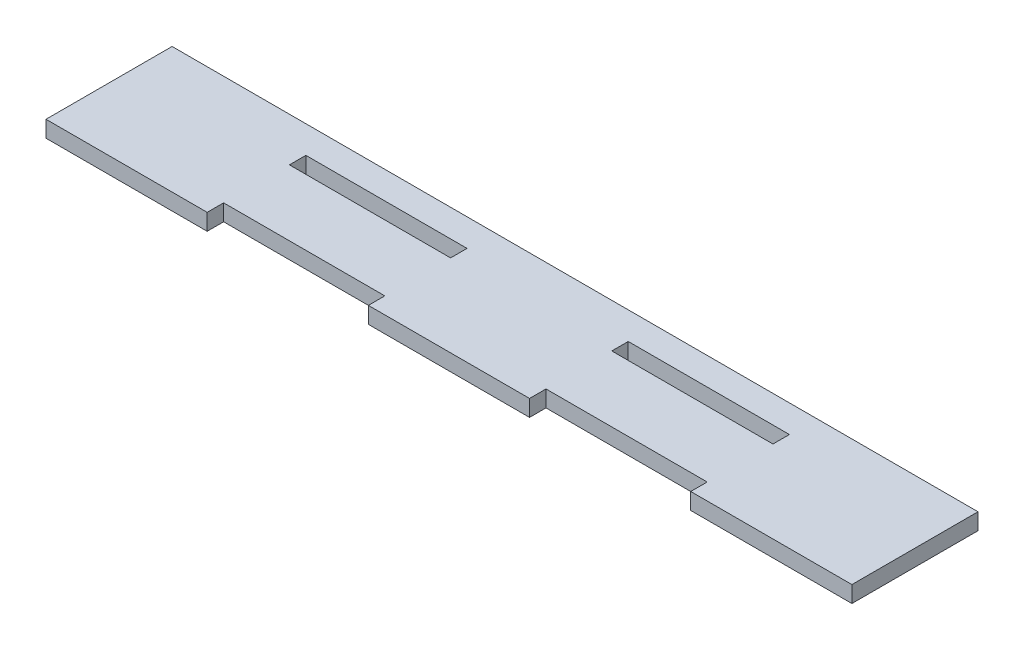
ISO-10303-21;
HEADER;
FILE_DESCRIPTION(('STEP AP214'),'2;1');
FILE_NAME('part.step','',(''),(''),'','','');
FILE_SCHEMA(('AUTOMOTIVE_DESIGN { 1 0 10303 214 1 1 1 1 }'));
ENDSEC;
DATA;
#1=APPLICATION_CONTEXT('core data for automotive mechanical design processes');
#2=APPLICATION_PROTOCOL_DEFINITION('international standard','automotive_design',2000,#1);
#3=PRODUCT_CONTEXT('',#1,'mechanical');
#4=PRODUCT('Part','Part','',(#3));
#5=PRODUCT_RELATED_PRODUCT_CATEGORY('part','',(#4));
#6=PRODUCT_DEFINITION_FORMATION('','',#4);
#7=PRODUCT_DEFINITION_CONTEXT('part definition',#1,'design');
#8=PRODUCT_DEFINITION('design','',#6,#7);
#9=PRODUCT_DEFINITION_SHAPE('','',#8);
#10=(LENGTH_UNIT() NAMED_UNIT(*) SI_UNIT(.MILLI.,.METRE.));
#11=(NAMED_UNIT(*) PLANE_ANGLE_UNIT() SI_UNIT($,.RADIAN.));
#12=(NAMED_UNIT(*) SI_UNIT($,.STERADIAN.) SOLID_ANGLE_UNIT());
#13=UNCERTAINTY_MEASURE_WITH_UNIT(LENGTH_MEASURE(1.E-05),#10,'distance_accuracy_value','');
#14=(GEOMETRIC_REPRESENTATION_CONTEXT(3) GLOBAL_UNCERTAINTY_ASSIGNED_CONTEXT((#13)) GLOBAL_UNIT_ASSIGNED_CONTEXT((#10,
#11,#12)) REPRESENTATION_CONTEXT('',''));
#15=CARTESIAN_POINT('',(0.,0.,0.));
#16=DIRECTION('',(0.,0.,1.));
#17=DIRECTION('',(1.,0.,0.));
#18=AXIS2_PLACEMENT_3D('',#15,#16,#17);
#19=CARTESIAN_POINT('',(0.,3.,0.));
#20=DIRECTION('',(0.,-1.,0.));
#21=DIRECTION('',(0.,0.,-1.));
#22=AXIS2_PLACEMENT_3D('',#19,#20,#21);
#23=PLANE('',#22);
#24=DIRECTION('',(0.,0.,-1.));
#25=VECTOR('',#24,1.);
#26=CARTESIAN_POINT('',(-14.7,3.,-2.5));
#27=LINE('',#26,#25);
#28=CARTESIAN_POINT('',(-14.7,3.,0.499999999999998));
#29=VERTEX_POINT('',#28);
#30=CARTESIAN_POINT('',(-14.7,3.,-2.5));
#31=VERTEX_POINT('',#30);
#32=EDGE_CURVE('E205',#29,#31,#27,.T.);
#33=ORIENTED_EDGE('',*,*,#32,.F.);
#34=DIRECTION('',(1.,0.,0.));
#35=VECTOR('',#34,1.);
#36=CARTESIAN_POINT('',(-44.1,3.,0.499999999999998));
#37=LINE('',#36,#35);
#38=CARTESIAN_POINT('',(-44.1,3.,0.499999999999998));
#39=VERTEX_POINT('',#38);
#40=EDGE_CURVE('E213',#39,#29,#37,.T.);
#41=ORIENTED_EDGE('',*,*,#40,.F.);
#42=DIRECTION('',(0.,0.,1.));
#43=VECTOR('',#42,1.);
#44=CARTESIAN_POINT('',(-44.1,3.,-2.5));
#45=LINE('',#44,#43);
#46=CARTESIAN_POINT('',(-44.1,3.,-2.5));
#47=VERTEX_POINT('',#46);
#48=EDGE_CURVE('E210',#47,#39,#45,.T.);
#49=ORIENTED_EDGE('',*,*,#48,.F.);
#50=DIRECTION('',(-1.,0.,0.));
#51=VECTOR('',#50,1.);
#52=CARTESIAN_POINT('',(-44.1,3.,-2.5));
#53=LINE('',#52,#51);
#54=EDGE_CURVE('E207',#31,#47,#53,.T.);
#55=ORIENTED_EDGE('',*,*,#54,.F.);
#56=EDGE_LOOP('',(#33,#41,#49,#55));
#57=FACE_BOUND('',#56,.T.);
#58=DIRECTION('',(1.,0.,0.));
#59=VECTOR('',#58,1.);
#60=CARTESIAN_POINT('',(44.1,3.,15.5));
#61=LINE('',#60,#59);
#62=CARTESIAN_POINT('',(44.1,3.,15.5));
#63=VERTEX_POINT('',#62);
#64=CARTESIAN_POINT('',(73.5,3.,15.5));
#65=VERTEX_POINT('',#64);
#66=EDGE_CURVE('E236',#63,#65,#61,.T.);
#67=ORIENTED_EDGE('',*,*,#66,.T.);
#68=DIRECTION('',(0.,0.,-1.));
#69=VECTOR('',#68,1.);
#70=CARTESIAN_POINT('',(73.5,3.,-7.5));
#71=LINE('',#70,#69);
#72=CARTESIAN_POINT('',(73.5,3.,-7.5));
#73=VERTEX_POINT('',#72);
#74=EDGE_CURVE('E239',#65,#73,#71,.T.);
#75=ORIENTED_EDGE('',*,*,#74,.T.);
#76=DIRECTION('',(-1.,0.,0.));
#77=VECTOR('',#76,1.);
#78=CARTESIAN_POINT('',(-73.5,3.,-7.5));
#79=LINE('',#78,#77);
#80=CARTESIAN_POINT('',(-73.5,3.,-7.5));
#81=VERTEX_POINT('',#80);
#82=EDGE_CURVE('E242',#73,#81,#79,.T.);
#83=ORIENTED_EDGE('',*,*,#82,.T.);
#84=DIRECTION('',(0.,0.,1.));
#85=VECTOR('',#84,1.);
#86=CARTESIAN_POINT('',(-73.5,3.,-7.5));
#87=LINE('',#86,#85);
#88=CARTESIAN_POINT('',(-73.5,3.,15.5));
#89=VERTEX_POINT('',#88);
#90=EDGE_CURVE('E244',#81,#89,#87,.T.);
#91=ORIENTED_EDGE('',*,*,#90,.T.);
#92=DIRECTION('',(1.,0.,0.));
#93=VECTOR('',#92,1.);
#94=CARTESIAN_POINT('',(-73.5,3.,15.5));
#95=LINE('',#94,#93);
#96=CARTESIAN_POINT('',(-44.1,3.,15.5));
#97=VERTEX_POINT('',#96);
#98=EDGE_CURVE('E246',#89,#97,#95,.T.);
#99=ORIENTED_EDGE('',*,*,#98,.T.);
#100=DIRECTION('',(0.,0.,-1.));
#101=VECTOR('',#100,1.);
#102=CARTESIAN_POINT('',(-44.1,3.,12.5));
#103=LINE('',#102,#101);
#104=CARTESIAN_POINT('',(-44.1,3.,12.5));
#105=VERTEX_POINT('',#104);
#106=EDGE_CURVE('E248',#97,#105,#103,.T.);
#107=ORIENTED_EDGE('',*,*,#106,.T.);
#108=DIRECTION('',(1.,0.,0.));
#109=VECTOR('',#108,1.);
#110=CARTESIAN_POINT('',(-44.1,3.,12.5));
#111=LINE('',#110,#109);
#112=CARTESIAN_POINT('',(-14.7,3.,12.5));
#113=VERTEX_POINT('',#112);
#114=EDGE_CURVE('E250',#105,#113,#111,.T.);
#115=ORIENTED_EDGE('',*,*,#114,.T.);
#116=DIRECTION('',(0.,0.,1.));
#117=VECTOR('',#116,1.);
#118=CARTESIAN_POINT('',(-14.7,3.,12.5));
#119=LINE('',#118,#117);
#120=CARTESIAN_POINT('',(-14.7,3.,15.5));
#121=VERTEX_POINT('',#120);
#122=EDGE_CURVE('E252',#113,#121,#119,.T.);
#123=ORIENTED_EDGE('',*,*,#122,.T.);
#124=DIRECTION('',(1.,0.,0.));
#125=VECTOR('',#124,1.);
#126=CARTESIAN_POINT('',(-14.7,3.,15.5));
#127=LINE('',#126,#125);
#128=CARTESIAN_POINT('',(14.7,3.,15.5));
#129=VERTEX_POINT('',#128);
#130=EDGE_CURVE('E254',#121,#129,#127,.T.);
#131=ORIENTED_EDGE('',*,*,#130,.T.);
#132=DIRECTION('',(0.,0.,-1.));
#133=VECTOR('',#132,1.);
#134=CARTESIAN_POINT('',(14.7,3.,12.5));
#135=LINE('',#134,#133);
#136=CARTESIAN_POINT('',(14.7,3.,12.5));
#137=VERTEX_POINT('',#136);
#138=EDGE_CURVE('E256',#129,#137,#135,.T.);
#139=ORIENTED_EDGE('',*,*,#138,.T.);
#140=DIRECTION('',(1.,0.,0.));
#141=VECTOR('',#140,1.);
#142=CARTESIAN_POINT('',(14.7,3.,12.5));
#143=LINE('',#142,#141);
#144=CARTESIAN_POINT('',(44.1,3.,12.5));
#145=VERTEX_POINT('',#144);
#146=EDGE_CURVE('E258',#137,#145,#143,.T.);
#147=ORIENTED_EDGE('',*,*,#146,.T.);
#148=DIRECTION('',(0.,0.,1.));
#149=VECTOR('',#148,1.);
#150=CARTESIAN_POINT('',(44.1,3.,12.5));
#151=LINE('',#150,#149);
#152=EDGE_CURVE('E260',#145,#63,#151,.T.);
#153=ORIENTED_EDGE('',*,*,#152,.T.);
#154=EDGE_LOOP('',(#67,#75,#83,#91,#99,#107,#115,#123,#131,#139,#147,#153));
#155=FACE_BOUND('',#154,.T.);
#156=DIRECTION('',(0.,0.,1.));
#157=VECTOR('',#156,1.);
#158=CARTESIAN_POINT('',(14.7,3.,-2.5));
#159=LINE('',#158,#157);
#160=CARTESIAN_POINT('',(14.7,3.,-2.5));
#161=VERTEX_POINT('',#160);
#162=CARTESIAN_POINT('',(14.7,3.,0.499999999999998));
#163=VERTEX_POINT('',#162);
#164=EDGE_CURVE('E169',#161,#163,#159,.T.);
#165=ORIENTED_EDGE('',*,*,#164,.F.);
#166=DIRECTION('',(-1.,0.,0.));
#167=VECTOR('',#166,1.);
#168=CARTESIAN_POINT('',(14.7,3.,-2.5));
#169=LINE('',#168,#167);
#170=CARTESIAN_POINT('',(44.1,3.,-2.50000000000001));
#171=VERTEX_POINT('',#170);
#172=EDGE_CURVE('E191',#171,#161,#169,.T.);
#173=ORIENTED_EDGE('',*,*,#172,.F.);
#174=DIRECTION('',(0.,0.,-1.));
#175=VECTOR('',#174,1.);
#176=CARTESIAN_POINT('',(44.1,3.,-2.50000000000001));
#177=LINE('',#176,#175);
#178=CARTESIAN_POINT('',(44.1,3.,0.499999999999998));
#179=VERTEX_POINT('',#178);
#180=EDGE_CURVE('E189',#179,#171,#177,.T.);
#181=ORIENTED_EDGE('',*,*,#180,.F.);
#182=DIRECTION('',(1.,0.,0.));
#183=VECTOR('',#182,1.);
#184=CARTESIAN_POINT('',(14.7,3.,0.499999999999998));
#185=LINE('',#184,#183);
#186=EDGE_CURVE('E177',#163,#179,#185,.T.);
#187=ORIENTED_EDGE('',*,*,#186,.F.);
#188=EDGE_LOOP('',(#165,#173,#181,#187));
#189=FACE_BOUND('',#188,.T.);
#190=ADVANCED_FACE('F32',(#57,#155,#189),#23,.F.);
#191=CARTESIAN_POINT('',(0.,0.,0.));
#192=DIRECTION('',(0.,-1.,0.));
#193=DIRECTION('',(0.,0.,-1.));
#194=AXIS2_PLACEMENT_3D('',#191,#192,#193);
#195=PLANE('',#194);
#196=DIRECTION('',(1.,0.,0.));
#197=VECTOR('',#196,1.);
#198=CARTESIAN_POINT('',(44.1,0.,15.5));
#199=LINE('',#198,#197);
#200=CARTESIAN_POINT('',(44.1,0.,15.5));
#201=VERTEX_POINT('',#200);
#202=CARTESIAN_POINT('',(73.5,0.,15.5));
#203=VERTEX_POINT('',#202);
#204=EDGE_CURVE('E235',#201,#203,#199,.T.);
#205=ORIENTED_EDGE('',*,*,#204,.F.);
#206=DIRECTION('',(0.,0.,1.));
#207=VECTOR('',#206,1.);
#208=CARTESIAN_POINT('',(44.1,0.,12.5));
#209=LINE('',#208,#207);
#210=CARTESIAN_POINT('',(44.1,0.,12.5));
#211=VERTEX_POINT('',#210);
#212=EDGE_CURVE('E240',#211,#201,#209,.T.);
#213=ORIENTED_EDGE('',*,*,#212,.F.);
#214=DIRECTION('',(1.,0.,0.));
#215=VECTOR('',#214,1.);
#216=CARTESIAN_POINT('',(14.7,0.,12.5));
#217=LINE('',#216,#215);
#218=CARTESIAN_POINT('',(14.7,0.,12.5));
#219=VERTEX_POINT('',#218);
#220=EDGE_CURVE('E283',#219,#211,#217,.T.);
#221=ORIENTED_EDGE('',*,*,#220,.F.);
#222=DIRECTION('',(0.,0.,-1.));
#223=VECTOR('',#222,1.);
#224=CARTESIAN_POINT('',(14.7,0.,12.5));
#225=LINE('',#224,#223);
#226=CARTESIAN_POINT('',(14.7,0.,15.5));
#227=VERTEX_POINT('',#226);
#228=EDGE_CURVE('E281',#227,#219,#225,.T.);
#229=ORIENTED_EDGE('',*,*,#228,.F.);
#230=DIRECTION('',(1.,0.,0.));
#231=VECTOR('',#230,1.);
#232=CARTESIAN_POINT('',(-14.7,0.,15.5));
#233=LINE('',#232,#231);
#234=CARTESIAN_POINT('',(-14.7,0.,15.5));
#235=VERTEX_POINT('',#234);
#236=EDGE_CURVE('E279',#235,#227,#233,.T.);
#237=ORIENTED_EDGE('',*,*,#236,.F.);
#238=DIRECTION('',(0.,0.,1.));
#239=VECTOR('',#238,1.);
#240=CARTESIAN_POINT('',(-14.7,0.,12.5));
#241=LINE('',#240,#239);
#242=CARTESIAN_POINT('',(-14.7,0.,12.5));
#243=VERTEX_POINT('',#242);
#244=EDGE_CURVE('E277',#243,#235,#241,.T.);
#245=ORIENTED_EDGE('',*,*,#244,.F.);
#246=DIRECTION('',(1.,0.,0.));
#247=VECTOR('',#246,1.);
#248=CARTESIAN_POINT('',(-44.1,0.,12.5));
#249=LINE('',#248,#247);
#250=CARTESIAN_POINT('',(-44.1,0.,12.5));
#251=VERTEX_POINT('',#250);
#252=EDGE_CURVE('E275',#251,#243,#249,.T.);
#253=ORIENTED_EDGE('',*,*,#252,.F.);
#254=DIRECTION('',(0.,0.,-1.));
#255=VECTOR('',#254,1.);
#256=CARTESIAN_POINT('',(-44.1,0.,12.5));
#257=LINE('',#256,#255);
#258=CARTESIAN_POINT('',(-44.1,0.,15.5));
#259=VERTEX_POINT('',#258);
#260=EDGE_CURVE('E273',#259,#251,#257,.T.);
#261=ORIENTED_EDGE('',*,*,#260,.F.);
#262=DIRECTION('',(1.,0.,0.));
#263=VECTOR('',#262,1.);
#264=CARTESIAN_POINT('',(-73.5,0.,15.5));
#265=LINE('',#264,#263);
#266=CARTESIAN_POINT('',(-73.5,0.,15.5));
#267=VERTEX_POINT('',#266);
#268=EDGE_CURVE('E271',#267,#259,#265,.T.);
#269=ORIENTED_EDGE('',*,*,#268,.F.);
#270=DIRECTION('',(0.,0.,1.));
#271=VECTOR('',#270,1.);
#272=CARTESIAN_POINT('',(-73.5,0.,-7.5));
#273=LINE('',#272,#271);
#274=CARTESIAN_POINT('',(-73.5,0.,-7.5));
#275=VERTEX_POINT('',#274);
#276=EDGE_CURVE('E269',#275,#267,#273,.T.);
#277=ORIENTED_EDGE('',*,*,#276,.F.);
#278=DIRECTION('',(-1.,0.,0.));
#279=VECTOR('',#278,1.);
#280=CARTESIAN_POINT('',(-73.5,0.,-7.5));
#281=LINE('',#280,#279);
#282=CARTESIAN_POINT('',(73.5,0.,-7.5));
#283=VERTEX_POINT('',#282);
#284=EDGE_CURVE('E267',#283,#275,#281,.T.);
#285=ORIENTED_EDGE('',*,*,#284,.F.);
#286=DIRECTION('',(0.,0.,-1.));
#287=VECTOR('',#286,1.);
#288=CARTESIAN_POINT('',(73.5,0.,-7.5));
#289=LINE('',#288,#287);
#290=EDGE_CURVE('E265',#203,#283,#289,.T.);
#291=ORIENTED_EDGE('',*,*,#290,.F.);
#292=EDGE_LOOP('',(#205,#213,#221,#229,#237,#245,#253,#261,#269,#277,#285,#291));
#293=FACE_BOUND('',#292,.T.);
#294=DIRECTION('',(1.,0.,0.));
#295=VECTOR('',#294,1.);
#296=CARTESIAN_POINT('',(-44.1,0.,0.499999999999998));
#297=LINE('',#296,#295);
#298=CARTESIAN_POINT('',(-44.1,0.,0.499999999999998));
#299=VERTEX_POINT('',#298);
#300=CARTESIAN_POINT('',(-14.7,0.,0.499999999999998));
#301=VERTEX_POINT('',#300);
#302=EDGE_CURVE('E208',#299,#301,#297,.T.);
#303=ORIENTED_EDGE('',*,*,#302,.T.);
#304=DIRECTION('',(0.,0.,-1.));
#305=VECTOR('',#304,1.);
#306=CARTESIAN_POINT('',(-14.7,0.,-2.5));
#307=LINE('',#306,#305);
#308=CARTESIAN_POINT('',(-14.7,0.,-2.5));
#309=VERTEX_POINT('',#308);
#310=EDGE_CURVE('E185',#301,#309,#307,.T.);
#311=ORIENTED_EDGE('',*,*,#310,.T.);
#312=DIRECTION('',(-1.,0.,0.));
#313=VECTOR('',#312,1.);
#314=CARTESIAN_POINT('',(-44.1,0.,-2.5));
#315=LINE('',#314,#313);
#316=CARTESIAN_POINT('',(-44.1,0.,-2.5));
#317=VERTEX_POINT('',#316);
#318=EDGE_CURVE('E218',#309,#317,#315,.T.);
#319=ORIENTED_EDGE('',*,*,#318,.T.);
#320=DIRECTION('',(0.,0.,1.));
#321=VECTOR('',#320,1.);
#322=CARTESIAN_POINT('',(-44.1,0.,-2.5));
#323=LINE('',#322,#321);
#324=EDGE_CURVE('E221',#317,#299,#323,.T.);
#325=ORIENTED_EDGE('',*,*,#324,.T.);
#326=EDGE_LOOP('',(#303,#311,#319,#325));
#327=FACE_BOUND('',#326,.T.);
#328=DIRECTION('',(-1.,0.,0.));
#329=VECTOR('',#328,1.);
#330=CARTESIAN_POINT('',(14.7,0.,-2.5));
#331=LINE('',#330,#329);
#332=CARTESIAN_POINT('',(44.1,0.,-2.50000000000001));
#333=VERTEX_POINT('',#332);
#334=CARTESIAN_POINT('',(14.7,0.,-2.5));
#335=VERTEX_POINT('',#334);
#336=EDGE_CURVE('E178',#333,#335,#331,.T.);
#337=ORIENTED_EDGE('',*,*,#336,.T.);
#338=DIRECTION('',(0.,0.,1.));
#339=VECTOR('',#338,1.);
#340=CARTESIAN_POINT('',(14.7,0.,-2.5));
#341=LINE('',#340,#339);
#342=CARTESIAN_POINT('',(14.7,0.,0.499999999999998));
#343=VERTEX_POINT('',#342);
#344=EDGE_CURVE('E55',#335,#343,#341,.T.);
#345=ORIENTED_EDGE('',*,*,#344,.T.);
#346=DIRECTION('',(1.,0.,0.));
#347=VECTOR('',#346,1.);
#348=CARTESIAN_POINT('',(14.7,0.,0.499999999999998));
#349=LINE('',#348,#347);
#350=CARTESIAN_POINT('',(44.1,0.,0.499999999999998));
#351=VERTEX_POINT('',#350);
#352=EDGE_CURVE('E184',#343,#351,#349,.T.);
#353=ORIENTED_EDGE('',*,*,#352,.T.);
#354=DIRECTION('',(0.,0.,-1.));
#355=VECTOR('',#354,1.);
#356=CARTESIAN_POINT('',(44.1,0.,-2.50000000000001));
#357=LINE('',#356,#355);
#358=EDGE_CURVE('E197',#351,#333,#357,.T.);
#359=ORIENTED_EDGE('',*,*,#358,.T.);
#360=EDGE_LOOP('',(#337,#345,#353,#359));
#361=FACE_BOUND('',#360,.T.);
#362=ADVANCED_FACE('F325',(#293,#327,#361),#195,.T.);
#363=CARTESIAN_POINT('',(44.1,3.,15.5));
#364=DIRECTION('',(0.,0.,-1.));
#365=DIRECTION('',(-1.,0.,0.));
#366=AXIS2_PLACEMENT_3D('',#363,#364,#365);
#367=PLANE('',#366);
#368=ORIENTED_EDGE('',*,*,#204,.T.);
#369=DIRECTION('',(0.,-1.,0.));
#370=VECTOR('',#369,1.);
#371=CARTESIAN_POINT('',(73.5,3.,15.5));
#372=LINE('',#371,#370);
#373=EDGE_CURVE('E11',#65,#203,#372,.T.);
#374=ORIENTED_EDGE('',*,*,#373,.F.);
#375=ORIENTED_EDGE('',*,*,#66,.F.);
#376=DIRECTION('',(0.,-1.,0.));
#377=VECTOR('',#376,1.);
#378=CARTESIAN_POINT('',(44.1,3.,15.5));
#379=LINE('',#378,#377);
#380=EDGE_CURVE('E262',#63,#201,#379,.T.);
#381=ORIENTED_EDGE('',*,*,#380,.T.);
#382=EDGE_LOOP('',(#368,#374,#375,#381));
#383=FACE_BOUND('',#382,.T.);
#384=ADVANCED_FACE('F34',(#383),#367,.F.);
#385=CARTESIAN_POINT('',(73.5,3.,-7.5));
#386=DIRECTION('',(-1.,0.,0.));
#387=DIRECTION('',(0.,0.,1.));
#388=AXIS2_PLACEMENT_3D('',#385,#386,#387);
#389=PLANE('',#388);
#390=ORIENTED_EDGE('',*,*,#290,.T.);
#391=DIRECTION('',(0.,-1.,0.));
#392=VECTOR('',#391,1.);
#393=CARTESIAN_POINT('',(73.5,3.,-7.5));
#394=LINE('',#393,#392);
#395=EDGE_CURVE('E40',#73,#283,#394,.T.);
#396=ORIENTED_EDGE('',*,*,#395,.F.);
#397=ORIENTED_EDGE('',*,*,#74,.F.);
#398=ORIENTED_EDGE('',*,*,#373,.T.);
#399=EDGE_LOOP('',(#390,#396,#397,#398));
#400=FACE_BOUND('',#399,.T.);
#401=ADVANCED_FACE('F342',(#400),#389,.F.);
#402=CARTESIAN_POINT('',(-73.5,3.,-7.5));
#403=DIRECTION('',(0.,0.,1.));
#404=DIRECTION('',(1.,0.,0.));
#405=AXIS2_PLACEMENT_3D('',#402,#403,#404);
#406=PLANE('',#405);
#407=ORIENTED_EDGE('',*,*,#284,.T.);
#408=DIRECTION('',(0.,-1.,0.));
#409=VECTOR('',#408,1.);
#410=CARTESIAN_POINT('',(-73.5,3.,-7.5));
#411=LINE('',#410,#409);
#412=EDGE_CURVE('E312',#81,#275,#411,.T.);
#413=ORIENTED_EDGE('',*,*,#412,.F.);
#414=ORIENTED_EDGE('',*,*,#82,.F.);
#415=ORIENTED_EDGE('',*,*,#395,.T.);
#416=EDGE_LOOP('',(#407,#413,#414,#415));
#417=FACE_BOUND('',#416,.T.);
#418=ADVANCED_FACE('F319',(#417),#406,.F.);
#419=CARTESIAN_POINT('',(-73.5,3.,-7.5));
#420=DIRECTION('',(1.,0.,0.));
#421=DIRECTION('',(0.,0.,-1.));
#422=AXIS2_PLACEMENT_3D('',#419,#420,#421);
#423=PLANE('',#422);
#424=ORIENTED_EDGE('',*,*,#276,.T.);
#425=DIRECTION('',(0.,-1.,0.));
#426=VECTOR('',#425,1.);
#427=CARTESIAN_POINT('',(-73.5,3.,15.5));
#428=LINE('',#427,#426);
#429=EDGE_CURVE('E309',#89,#267,#428,.T.);
#430=ORIENTED_EDGE('',*,*,#429,.F.);
#431=ORIENTED_EDGE('',*,*,#90,.F.);
#432=ORIENTED_EDGE('',*,*,#412,.T.);
#433=EDGE_LOOP('',(#424,#430,#431,#432));
#434=FACE_BOUND('',#433,.T.);
#435=ADVANCED_FACE('F331',(#434),#423,.F.);
#436=CARTESIAN_POINT('',(-73.5,3.,15.5));
#437=DIRECTION('',(0.,0.,-1.));
#438=DIRECTION('',(-1.,0.,0.));
#439=AXIS2_PLACEMENT_3D('',#436,#437,#438);
#440=PLANE('',#439);
#441=ORIENTED_EDGE('',*,*,#268,.T.);
#442=DIRECTION('',(0.,-1.,0.));
#443=VECTOR('',#442,1.);
#444=CARTESIAN_POINT('',(-44.1,3.,15.5));
#445=LINE('',#444,#443);
#446=EDGE_CURVE('E306',#97,#259,#445,.T.);
#447=ORIENTED_EDGE('',*,*,#446,.F.);
#448=ORIENTED_EDGE('',*,*,#98,.F.);
#449=ORIENTED_EDGE('',*,*,#429,.T.);
#450=EDGE_LOOP('',(#441,#447,#448,#449));
#451=FACE_BOUND('',#450,.T.);
#452=ADVANCED_FACE('F335',(#451),#440,.F.);
#453=CARTESIAN_POINT('',(-44.1,3.,12.5));
#454=DIRECTION('',(-1.,0.,0.));
#455=DIRECTION('',(0.,0.,1.));
#456=AXIS2_PLACEMENT_3D('',#453,#454,#455);
#457=PLANE('',#456);
#458=ORIENTED_EDGE('',*,*,#260,.T.);
#459=DIRECTION('',(0.,-1.,0.));
#460=VECTOR('',#459,1.);
#461=CARTESIAN_POINT('',(-44.1,3.,12.5));
#462=LINE('',#461,#460);
#463=EDGE_CURVE('E303',#105,#251,#462,.T.);
#464=ORIENTED_EDGE('',*,*,#463,.F.);
#465=ORIENTED_EDGE('',*,*,#106,.F.);
#466=ORIENTED_EDGE('',*,*,#446,.T.);
#467=EDGE_LOOP('',(#458,#464,#465,#466));
#468=FACE_BOUND('',#467,.T.);
#469=ADVANCED_FACE('F375',(#468),#457,.F.);
#470=CARTESIAN_POINT('',(-44.1,3.,12.5));
#471=DIRECTION('',(0.,0.,-1.));
#472=DIRECTION('',(-1.,0.,0.));
#473=AXIS2_PLACEMENT_3D('',#470,#471,#472);
#474=PLANE('',#473);
#475=ORIENTED_EDGE('',*,*,#252,.T.);
#476=DIRECTION('',(0.,-1.,0.));
#477=VECTOR('',#476,1.);
#478=CARTESIAN_POINT('',(-14.7,3.,12.5));
#479=LINE('',#478,#477);
#480=EDGE_CURVE('E300',#113,#243,#479,.T.);
#481=ORIENTED_EDGE('',*,*,#480,.F.);
#482=ORIENTED_EDGE('',*,*,#114,.F.);
#483=ORIENTED_EDGE('',*,*,#463,.T.);
#484=EDGE_LOOP('',(#475,#481,#482,#483));
#485=FACE_BOUND('',#484,.T.);
#486=ADVANCED_FACE('F373',(#485),#474,.F.);
#487=CARTESIAN_POINT('',(-14.7,3.,12.5));
#488=DIRECTION('',(1.,0.,0.));
#489=DIRECTION('',(0.,0.,-1.));
#490=AXIS2_PLACEMENT_3D('',#487,#488,#489);
#491=PLANE('',#490);
#492=ORIENTED_EDGE('',*,*,#244,.T.);
#493=DIRECTION('',(0.,-1.,0.));
#494=VECTOR('',#493,1.);
#495=CARTESIAN_POINT('',(-14.7,3.,15.5));
#496=LINE('',#495,#494);
#497=EDGE_CURVE('E297',#121,#235,#496,.T.);
#498=ORIENTED_EDGE('',*,*,#497,.F.);
#499=ORIENTED_EDGE('',*,*,#122,.F.);
#500=ORIENTED_EDGE('',*,*,#480,.T.);
#501=EDGE_LOOP('',(#492,#498,#499,#500));
#502=FACE_BOUND('',#501,.T.);
#503=ADVANCED_FACE('F369',(#502),#491,.F.);
#504=CARTESIAN_POINT('',(-14.7,3.,15.5));
#505=DIRECTION('',(0.,0.,-1.));
#506=DIRECTION('',(-1.,0.,0.));
#507=AXIS2_PLACEMENT_3D('',#504,#505,#506);
#508=PLANE('',#507);
#509=ORIENTED_EDGE('',*,*,#236,.T.);
#510=DIRECTION('',(0.,-1.,0.));
#511=VECTOR('',#510,1.);
#512=CARTESIAN_POINT('',(14.7,3.,15.5));
#513=LINE('',#512,#511);
#514=EDGE_CURVE('E294',#129,#227,#513,.T.);
#515=ORIENTED_EDGE('',*,*,#514,.F.);
#516=ORIENTED_EDGE('',*,*,#130,.F.);
#517=ORIENTED_EDGE('',*,*,#497,.T.);
#518=EDGE_LOOP('',(#509,#515,#516,#517));
#519=FACE_BOUND('',#518,.T.);
#520=ADVANCED_FACE('F364',(#519),#508,.F.);
#521=CARTESIAN_POINT('',(14.7,3.,12.5));
#522=DIRECTION('',(-1.,0.,0.));
#523=DIRECTION('',(0.,0.,1.));
#524=AXIS2_PLACEMENT_3D('',#521,#522,#523);
#525=PLANE('',#524);
#526=ORIENTED_EDGE('',*,*,#228,.T.);
#527=DIRECTION('',(0.,-1.,0.));
#528=VECTOR('',#527,1.);
#529=CARTESIAN_POINT('',(14.7,3.,12.5));
#530=LINE('',#529,#528);
#531=EDGE_CURVE('E291',#137,#219,#530,.T.);
#532=ORIENTED_EDGE('',*,*,#531,.F.);
#533=ORIENTED_EDGE('',*,*,#138,.F.);
#534=ORIENTED_EDGE('',*,*,#514,.T.);
#535=EDGE_LOOP('',(#526,#532,#533,#534));
#536=FACE_BOUND('',#535,.T.);
#537=ADVANCED_FACE('F358',(#536),#525,.F.);
#538=CARTESIAN_POINT('',(14.7,3.,12.5));
#539=DIRECTION('',(0.,0.,-1.));
#540=DIRECTION('',(-1.,0.,0.));
#541=AXIS2_PLACEMENT_3D('',#538,#539,#540);
#542=PLANE('',#541);
#543=ORIENTED_EDGE('',*,*,#220,.T.);
#544=DIRECTION('',(0.,-1.,0.));
#545=VECTOR('',#544,1.);
#546=CARTESIAN_POINT('',(44.1,3.,12.5));
#547=LINE('',#546,#545);
#548=EDGE_CURVE('E288',#145,#211,#547,.T.);
#549=ORIENTED_EDGE('',*,*,#548,.F.);
#550=ORIENTED_EDGE('',*,*,#146,.F.);
#551=ORIENTED_EDGE('',*,*,#531,.T.);
#552=EDGE_LOOP('',(#543,#549,#550,#551));
#553=FACE_BOUND('',#552,.T.);
#554=ADVANCED_FACE('F354',(#553),#542,.F.);
#555=CARTESIAN_POINT('',(44.1,3.,12.5));
#556=DIRECTION('',(1.,0.,0.));
#557=DIRECTION('',(0.,0.,-1.));
#558=AXIS2_PLACEMENT_3D('',#555,#556,#557);
#559=PLANE('',#558);
#560=ORIENTED_EDGE('',*,*,#212,.T.);
#561=ORIENTED_EDGE('',*,*,#380,.F.);
#562=ORIENTED_EDGE('',*,*,#152,.F.);
#563=ORIENTED_EDGE('',*,*,#548,.T.);
#564=EDGE_LOOP('',(#560,#561,#562,#563));
#565=FACE_BOUND('',#564,.T.);
#566=ADVANCED_FACE('F349',(#565),#559,.F.);
#567=CARTESIAN_POINT('',(-14.7,3.,-2.5));
#568=DIRECTION('',(-1.,0.,0.));
#569=DIRECTION('',(0.,0.,1.));
#570=AXIS2_PLACEMENT_3D('',#567,#568,#569);
#571=PLANE('',#570);
#572=ORIENTED_EDGE('',*,*,#310,.F.);
#573=DIRECTION('',(0.,-1.,0.));
#574=VECTOR('',#573,1.);
#575=CARTESIAN_POINT('',(-14.7,3.,0.499999999999998));
#576=LINE('',#575,#574);
#577=EDGE_CURVE('E215',#29,#301,#576,.T.);
#578=ORIENTED_EDGE('',*,*,#577,.F.);
#579=ORIENTED_EDGE('',*,*,#32,.T.);
#580=DIRECTION('',(0.,-1.,0.));
#581=VECTOR('',#580,1.);
#582=CARTESIAN_POINT('',(-14.7,3.,-2.5));
#583=LINE('',#582,#581);
#584=EDGE_CURVE('E232',#31,#309,#583,.T.);
#585=ORIENTED_EDGE('',*,*,#584,.T.);
#586=EDGE_LOOP('',(#572,#578,#579,#585));
#587=FACE_BOUND('',#586,.T.);
#588=ADVANCED_FACE('F393',(#587),#571,.T.);
#589=CARTESIAN_POINT('',(-44.1,3.,-2.5));
#590=DIRECTION('',(0.,0.,1.));
#591=DIRECTION('',(1.,0.,0.));
#592=AXIS2_PLACEMENT_3D('',#589,#590,#591);
#593=PLANE('',#592);
#594=ORIENTED_EDGE('',*,*,#318,.F.);
#595=ORIENTED_EDGE('',*,*,#584,.F.);
#596=ORIENTED_EDGE('',*,*,#54,.T.);
#597=DIRECTION('',(0.,-1.,0.));
#598=VECTOR('',#597,1.);
#599=CARTESIAN_POINT('',(-44.1,3.,-2.5));
#600=LINE('',#599,#598);
#601=EDGE_CURVE('E230',#47,#317,#600,.T.);
#602=ORIENTED_EDGE('',*,*,#601,.T.);
#603=EDGE_LOOP('',(#594,#595,#596,#602));
#604=FACE_BOUND('',#603,.T.);
#605=ADVANCED_FACE('F431',(#604),#593,.T.);
#606=CARTESIAN_POINT('',(-44.1,3.,-2.5));
#607=DIRECTION('',(1.,0.,0.));
#608=DIRECTION('',(0.,0.,-1.));
#609=AXIS2_PLACEMENT_3D('',#606,#607,#608);
#610=PLANE('',#609);
#611=ORIENTED_EDGE('',*,*,#324,.F.);
#612=ORIENTED_EDGE('',*,*,#601,.F.);
#613=ORIENTED_EDGE('',*,*,#48,.T.);
#614=DIRECTION('',(0.,-1.,0.));
#615=VECTOR('',#614,1.);
#616=CARTESIAN_POINT('',(-44.1,3.,0.499999999999998));
#617=LINE('',#616,#615);
#618=EDGE_CURVE('E228',#39,#299,#617,.T.);
#619=ORIENTED_EDGE('',*,*,#618,.T.);
#620=EDGE_LOOP('',(#611,#612,#613,#619));
#621=FACE_BOUND('',#620,.T.);
#622=ADVANCED_FACE('F438',(#621),#610,.T.);
#623=CARTESIAN_POINT('',(-44.1,3.,0.499999999999998));
#624=DIRECTION('',(0.,0.,-1.));
#625=DIRECTION('',(-1.,0.,0.));
#626=AXIS2_PLACEMENT_3D('',#623,#624,#625);
#627=PLANE('',#626);
#628=ORIENTED_EDGE('',*,*,#302,.F.);
#629=ORIENTED_EDGE('',*,*,#618,.F.);
#630=ORIENTED_EDGE('',*,*,#40,.T.);
#631=ORIENTED_EDGE('',*,*,#577,.T.);
#632=EDGE_LOOP('',(#628,#629,#630,#631));
#633=FACE_BOUND('',#632,.T.);
#634=ADVANCED_FACE('F445',(#633),#627,.T.);
#635=CARTESIAN_POINT('',(14.7,3.,-2.5));
#636=DIRECTION('',(1.,0.,0.));
#637=DIRECTION('',(0.,0.,-1.));
#638=AXIS2_PLACEMENT_3D('',#635,#636,#637);
#639=PLANE('',#638);
#640=ORIENTED_EDGE('',*,*,#344,.F.);
#641=DIRECTION('',(0.,-1.,0.));
#642=VECTOR('',#641,1.);
#643=CARTESIAN_POINT('',(14.7,3.,-2.5));
#644=LINE('',#643,#642);
#645=EDGE_CURVE('E173',#161,#335,#644,.T.);
#646=ORIENTED_EDGE('',*,*,#645,.F.);
#647=ORIENTED_EDGE('',*,*,#164,.T.);
#648=DIRECTION('',(0.,-1.,0.));
#649=VECTOR('',#648,1.);
#650=CARTESIAN_POINT('',(14.7,3.,0.499999999999998));
#651=LINE('',#650,#649);
#652=EDGE_CURVE('E172',#163,#343,#651,.T.);
#653=ORIENTED_EDGE('',*,*,#652,.T.);
#654=EDGE_LOOP('',(#640,#646,#647,#653));
#655=FACE_BOUND('',#654,.T.);
#656=ADVANCED_FACE('F171',(#655),#639,.T.);
#657=CARTESIAN_POINT('',(14.7,3.,0.499999999999998));
#658=DIRECTION('',(0.,0.,-1.));
#659=DIRECTION('',(-1.,0.,0.));
#660=AXIS2_PLACEMENT_3D('',#657,#658,#659);
#661=PLANE('',#660);
#662=ORIENTED_EDGE('',*,*,#352,.F.);
#663=ORIENTED_EDGE('',*,*,#652,.F.);
#664=ORIENTED_EDGE('',*,*,#186,.T.);
#665=DIRECTION('',(0.,-1.,0.));
#666=VECTOR('',#665,1.);
#667=CARTESIAN_POINT('',(44.1,3.,0.499999999999998));
#668=LINE('',#667,#666);
#669=EDGE_CURVE('E186',#179,#351,#668,.T.);
#670=ORIENTED_EDGE('',*,*,#669,.T.);
#671=EDGE_LOOP('',(#662,#663,#664,#670));
#672=FACE_BOUND('',#671,.T.);
#673=ADVANCED_FACE('F181',(#672),#661,.T.);
#674=CARTESIAN_POINT('',(44.1,3.,-2.50000000000001));
#675=DIRECTION('',(-1.,0.,0.));
#676=DIRECTION('',(0.,0.,1.));
#677=AXIS2_PLACEMENT_3D('',#674,#675,#676);
#678=PLANE('',#677);
#679=ORIENTED_EDGE('',*,*,#358,.F.);
#680=ORIENTED_EDGE('',*,*,#669,.F.);
#681=ORIENTED_EDGE('',*,*,#180,.T.);
#682=DIRECTION('',(0.,-1.,0.));
#683=VECTOR('',#682,1.);
#684=CARTESIAN_POINT('',(44.1,3.,-2.50000000000001));
#685=LINE('',#684,#683);
#686=EDGE_CURVE('E47',#171,#333,#685,.T.);
#687=ORIENTED_EDGE('',*,*,#686,.T.);
#688=EDGE_LOOP('',(#679,#680,#681,#687));
#689=FACE_BOUND('',#688,.T.);
#690=ADVANCED_FACE('F466',(#689),#678,.T.);
#691=CARTESIAN_POINT('',(14.7,3.,-2.5));
#692=DIRECTION('',(0.,0.,1.));
#693=DIRECTION('',(1.,0.,0.));
#694=AXIS2_PLACEMENT_3D('',#691,#692,#693);
#695=PLANE('',#694);
#696=ORIENTED_EDGE('',*,*,#336,.F.);
#697=ORIENTED_EDGE('',*,*,#686,.F.);
#698=ORIENTED_EDGE('',*,*,#172,.T.);
#699=ORIENTED_EDGE('',*,*,#645,.T.);
#700=EDGE_LOOP('',(#696,#697,#698,#699));
#701=FACE_BOUND('',#700,.T.);
#702=ADVANCED_FACE('F473',(#701),#695,.T.);
#703=CLOSED_SHELL('',(#190,#362,#384,#401,#418,#435,#452,#469,#486,#503,#520,#537,#554,#566,
#588,#605,#622,#634,#656,#673,#690,#702));
#704=MANIFOLD_SOLID_BREP('B2',#703);
#705=ADVANCED_BREP_SHAPE_REPRESENTATION('',(#18,#704),#14);
#706=SHAPE_DEFINITION_REPRESENTATION(#9,#705);
ENDSEC;
END-ISO-10303-21;
